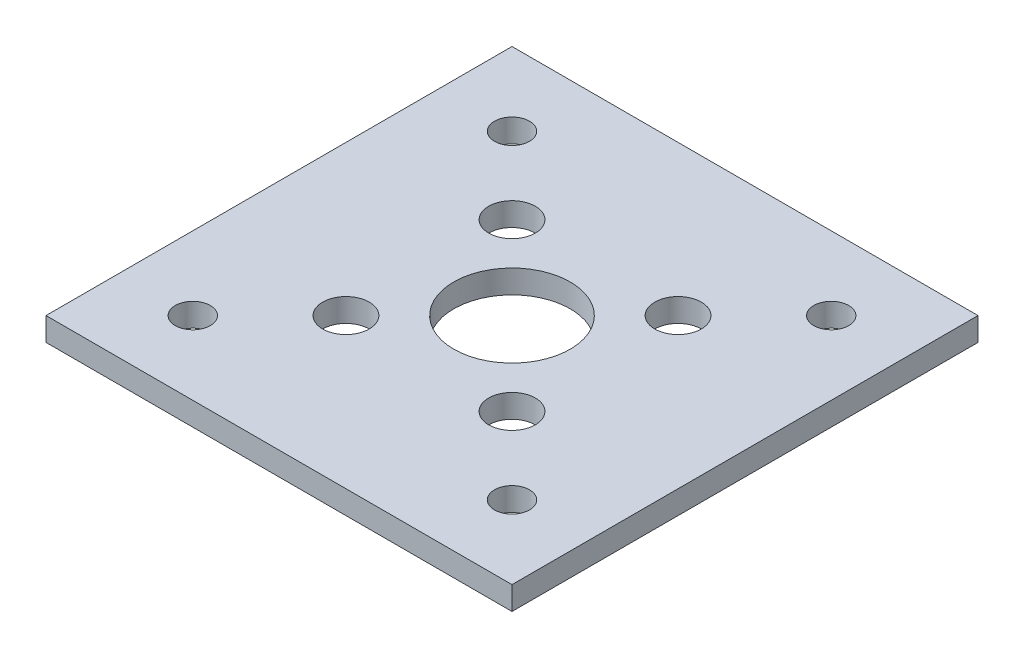
ISO-10303-21;
HEADER;
FILE_DESCRIPTION(('STEP AP214'),'2;1');
FILE_NAME('part.step','',(''),(''),'','','');
FILE_SCHEMA(('AUTOMOTIVE_DESIGN { 1 0 10303 214 1 1 1 1 }'));
ENDSEC;
DATA;
#1=APPLICATION_CONTEXT('core data for automotive mechanical design processes');
#2=APPLICATION_PROTOCOL_DEFINITION('international standard','automotive_design',2000,#1);
#3=PRODUCT_CONTEXT('',#1,'mechanical');
#4=PRODUCT('Part','Part','',(#3));
#5=PRODUCT_RELATED_PRODUCT_CATEGORY('part','',(#4));
#6=PRODUCT_DEFINITION_FORMATION('','',#4);
#7=PRODUCT_DEFINITION_CONTEXT('part definition',#1,'design');
#8=PRODUCT_DEFINITION('design','',#6,#7);
#9=PRODUCT_DEFINITION_SHAPE('','',#8);
#10=(LENGTH_UNIT() NAMED_UNIT(*) SI_UNIT(.MILLI.,.METRE.));
#11=(NAMED_UNIT(*) PLANE_ANGLE_UNIT() SI_UNIT($,.RADIAN.));
#12=(NAMED_UNIT(*) SI_UNIT($,.STERADIAN.) SOLID_ANGLE_UNIT());
#13=UNCERTAINTY_MEASURE_WITH_UNIT(LENGTH_MEASURE(1.E-05),#10,'distance_accuracy_value','');
#14=(GEOMETRIC_REPRESENTATION_CONTEXT(3) GLOBAL_UNCERTAINTY_ASSIGNED_CONTEXT((#13)) GLOBAL_UNIT_ASSIGNED_CONTEXT((#10,
#11,#12)) REPRESENTATION_CONTEXT('',''));
#15=CARTESIAN_POINT('',(0.,0.,0.));
#16=DIRECTION('',(0.,0.,1.));
#17=DIRECTION('',(1.,0.,0.));
#18=AXIS2_PLACEMENT_3D('',#15,#16,#17);
#19=CARTESIAN_POINT('',(31.75,3.175,31.75));
#20=DIRECTION('',(-1.,0.,0.));
#21=DIRECTION('',(0.,0.,1.));
#22=AXIS2_PLACEMENT_3D('',#19,#20,#21);
#23=PLANE('',#22);
#24=DIRECTION('',(0.,0.,-1.));
#25=VECTOR('',#24,1.);
#26=CARTESIAN_POINT('',(31.75,0.,31.75));
#27=LINE('',#26,#25);
#28=CARTESIAN_POINT('',(31.75,0.,31.75));
#29=VERTEX_POINT('',#28);
#30=CARTESIAN_POINT('',(31.75,0.,-31.75));
#31=VERTEX_POINT('',#30);
#32=EDGE_CURVE('E96',#29,#31,#27,.T.);
#33=ORIENTED_EDGE('',*,*,#32,.T.);
#34=DIRECTION('',(0.,-1.,0.));
#35=VECTOR('',#34,1.);
#36=CARTESIAN_POINT('',(31.75,3.175,-31.75));
#37=LINE('',#36,#35);
#38=CARTESIAN_POINT('',(31.75,3.175,-31.75));
#39=VERTEX_POINT('',#38);
#40=EDGE_CURVE('E11',#39,#31,#37,.T.);
#41=ORIENTED_EDGE('',*,*,#40,.F.);
#42=DIRECTION('',(0.,0.,-1.));
#43=VECTOR('',#42,1.);
#44=CARTESIAN_POINT('',(31.75,3.175,31.75));
#45=LINE('',#44,#43);
#46=CARTESIAN_POINT('',(31.75,3.175,31.75));
#47=VERTEX_POINT('',#46);
#48=EDGE_CURVE('E84',#47,#39,#45,.T.);
#49=ORIENTED_EDGE('',*,*,#48,.F.);
#50=DIRECTION('',(0.,-1.,0.));
#51=VECTOR('',#50,1.);
#52=CARTESIAN_POINT('',(31.75,3.175,31.75));
#53=LINE('',#52,#51);
#54=EDGE_CURVE('E92',#47,#29,#53,.T.);
#55=ORIENTED_EDGE('',*,*,#54,.T.);
#56=EDGE_LOOP('',(#33,#41,#49,#55));
#57=FACE_BOUND('',#56,.T.);
#58=ADVANCED_FACE('F33',(#57),#23,.F.);
#59=CARTESIAN_POINT('',(-31.75,3.175,-31.75));
#60=DIRECTION('',(0.,0.,1.));
#61=DIRECTION('',(1.,0.,0.));
#62=AXIS2_PLACEMENT_3D('',#59,#60,#61);
#63=PLANE('',#62);
#64=DIRECTION('',(-1.,0.,0.));
#65=VECTOR('',#64,1.);
#66=CARTESIAN_POINT('',(-31.75,0.,-31.75));
#67=LINE('',#66,#65);
#68=CARTESIAN_POINT('',(-31.75,0.,-31.75));
#69=VERTEX_POINT('',#68);
#70=EDGE_CURVE('E88',#31,#69,#67,.T.);
#71=ORIENTED_EDGE('',*,*,#70,.T.);
#72=DIRECTION('',(0.,-1.,0.));
#73=VECTOR('',#72,1.);
#74=CARTESIAN_POINT('',(-31.75,3.175,-31.75));
#75=LINE('',#74,#73);
#76=CARTESIAN_POINT('',(-31.75,3.175,-31.75));
#77=VERTEX_POINT('',#76);
#78=EDGE_CURVE('E41',#77,#69,#75,.T.);
#79=ORIENTED_EDGE('',*,*,#78,.F.);
#80=DIRECTION('',(-1.,0.,0.));
#81=VECTOR('',#80,1.);
#82=CARTESIAN_POINT('',(-31.75,3.175,-31.75));
#83=LINE('',#82,#81);
#84=EDGE_CURVE('E79',#39,#77,#83,.T.);
#85=ORIENTED_EDGE('',*,*,#84,.F.);
#86=ORIENTED_EDGE('',*,*,#40,.T.);
#87=EDGE_LOOP('',(#71,#79,#85,#86));
#88=FACE_BOUND('',#87,.T.);
#89=ADVANCED_FACE('F87',(#88),#63,.F.);
#90=CARTESIAN_POINT('',(-31.75,3.175,31.75));
#91=DIRECTION('',(1.,0.,0.));
#92=DIRECTION('',(0.,0.,-1.));
#93=AXIS2_PLACEMENT_3D('',#90,#91,#92);
#94=PLANE('',#93);
#95=DIRECTION('',(0.,0.,1.));
#96=VECTOR('',#95,1.);
#97=CARTESIAN_POINT('',(-31.75,0.,31.75));
#98=LINE('',#97,#96);
#99=CARTESIAN_POINT('',(-31.75,0.,31.75));
#100=VERTEX_POINT('',#99);
#101=EDGE_CURVE('E66',#69,#100,#98,.T.);
#102=ORIENTED_EDGE('',*,*,#101,.T.);
#103=DIRECTION('',(0.,-1.,0.));
#104=VECTOR('',#103,1.);
#105=CARTESIAN_POINT('',(-31.75,3.175,31.75));
#106=LINE('',#105,#104);
#107=CARTESIAN_POINT('',(-31.75,3.175,31.75));
#108=VERTEX_POINT('',#107);
#109=EDGE_CURVE('E89',#108,#100,#106,.T.);
#110=ORIENTED_EDGE('',*,*,#109,.F.);
#111=DIRECTION('',(0.,0.,1.));
#112=VECTOR('',#111,1.);
#113=CARTESIAN_POINT('',(-31.75,3.175,31.75));
#114=LINE('',#113,#112);
#115=EDGE_CURVE('E82',#77,#108,#114,.T.);
#116=ORIENTED_EDGE('',*,*,#115,.F.);
#117=ORIENTED_EDGE('',*,*,#78,.T.);
#118=EDGE_LOOP('',(#102,#110,#116,#117));
#119=FACE_BOUND('',#118,.T.);
#120=ADVANCED_FACE('F90',(#119),#94,.F.);
#121=CARTESIAN_POINT('',(-31.75,3.175,31.75));
#122=DIRECTION('',(0.,0.,-1.));
#123=DIRECTION('',(-1.,0.,0.));
#124=AXIS2_PLACEMENT_3D('',#121,#122,#123);
#125=PLANE('',#124);
#126=DIRECTION('',(1.,0.,0.));
#127=VECTOR('',#126,1.);
#128=CARTESIAN_POINT('',(-31.75,0.,31.75));
#129=LINE('',#128,#127);
#130=EDGE_CURVE('E72',#100,#29,#129,.T.);
#131=ORIENTED_EDGE('',*,*,#130,.T.);
#132=ORIENTED_EDGE('',*,*,#54,.F.);
#133=DIRECTION('',(1.,0.,0.));
#134=VECTOR('',#133,1.);
#135=CARTESIAN_POINT('',(-31.75,3.175,31.75));
#136=LINE('',#135,#134);
#137=EDGE_CURVE('E49',#108,#47,#136,.T.);
#138=ORIENTED_EDGE('',*,*,#137,.F.);
#139=ORIENTED_EDGE('',*,*,#109,.T.);
#140=EDGE_LOOP('',(#131,#132,#138,#139));
#141=FACE_BOUND('',#140,.T.);
#142=ADVANCED_FACE('F104',(#141),#125,.F.);
#143=CARTESIAN_POINT('',(0.,3.175,0.));
#144=DIRECTION('',(0.,-1.,0.));
#145=DIRECTION('',(0.,0.,-1.));
#146=AXIS2_PLACEMENT_3D('',#143,#144,#145);
#147=PLANE('',#146);
#148=CARTESIAN_POINT('',(0.,3.175,0.));
#149=DIRECTION('',(0.,1.,0.));
#150=DIRECTION('',(0.,0.,1.));
#151=AXIS2_PLACEMENT_3D('',#148,#149,#150);
#152=CIRCLE('',#151,7.9375);
#153=CARTESIAN_POINT('',(0.,3.175,7.9375));
#154=VERTEX_POINT('',#153);
#155=EDGE_CURVE('E135',#154,#154,#152,.T.);
#156=ORIENTED_EDGE('',*,*,#155,.F.);
#157=EDGE_LOOP('',(#156));
#158=FACE_BOUND('',#157,.T.);
#159=CARTESIAN_POINT('',(11.3137084989847,3.175,11.3137084989848));
#160=DIRECTION('',(0.,1.,0.));
#161=DIRECTION('',(0.,0.,1.));
#162=AXIS2_PLACEMENT_3D('',#159,#160,#161);
#163=CIRCLE('',#162,3.175);
#164=CARTESIAN_POINT('',(11.3137084989847,3.175,14.4887084989848));
#165=VERTEX_POINT('',#164);
#166=EDGE_CURVE('E129',#165,#165,#163,.T.);
#167=ORIENTED_EDGE('',*,*,#166,.F.);
#168=EDGE_LOOP('',(#167));
#169=FACE_BOUND('',#168,.T.);
#170=CARTESIAN_POINT('',(-11.3137084989848,3.175,11.3137084989847));
#171=DIRECTION('',(0.,1.,0.));
#172=DIRECTION('',(0.,0.,1.));
#173=AXIS2_PLACEMENT_3D('',#170,#171,#172);
#174=CIRCLE('',#173,3.175);
#175=CARTESIAN_POINT('',(-11.3137084989848,3.175,14.4887084989847));
#176=VERTEX_POINT('',#175);
#177=EDGE_CURVE('E123',#176,#176,#174,.T.);
#178=ORIENTED_EDGE('',*,*,#177,.F.);
#179=EDGE_LOOP('',(#178));
#180=FACE_BOUND('',#179,.T.);
#181=CARTESIAN_POINT('',(-11.3137084989847,3.175,-11.3137084989848));
#182=DIRECTION('',(0.,1.,0.));
#183=DIRECTION('',(0.,0.,1.));
#184=AXIS2_PLACEMENT_3D('',#181,#182,#183);
#185=CIRCLE('',#184,3.175);
#186=CARTESIAN_POINT('',(-11.3137084989847,3.175,-8.13870849898478));
#187=VERTEX_POINT('',#186);
#188=EDGE_CURVE('E116',#187,#187,#185,.T.);
#189=ORIENTED_EDGE('',*,*,#188,.F.);
#190=EDGE_LOOP('',(#189));
#191=FACE_BOUND('',#190,.T.);
#192=CARTESIAN_POINT('',(-21.75,3.175,21.75));
#193=DIRECTION('',(0.,1.,0.));
#194=DIRECTION('',(0.,0.,1.));
#195=AXIS2_PLACEMENT_3D('',#192,#193,#194);
#196=CIRCLE('',#195,2.38125);
#197=CARTESIAN_POINT('',(-21.75,3.175,24.13125));
#198=VERTEX_POINT('',#197);
#199=EDGE_CURVE('E158',#198,#198,#196,.T.);
#200=ORIENTED_EDGE('',*,*,#199,.F.);
#201=EDGE_LOOP('',(#200));
#202=FACE_BOUND('',#201,.T.);
#203=CARTESIAN_POINT('',(21.75,3.175,21.75));
#204=DIRECTION('',(0.,1.,0.));
#205=DIRECTION('',(0.,0.,1.));
#206=AXIS2_PLACEMENT_3D('',#203,#204,#205);
#207=CIRCLE('',#206,2.38125);
#208=CARTESIAN_POINT('',(21.75,3.175,24.13125));
#209=VERTEX_POINT('',#208);
#210=EDGE_CURVE('E152',#209,#209,#207,.T.);
#211=ORIENTED_EDGE('',*,*,#210,.F.);
#212=EDGE_LOOP('',(#211));
#213=FACE_BOUND('',#212,.T.);
#214=CARTESIAN_POINT('',(21.75,3.175,-21.75));
#215=DIRECTION('',(0.,1.,0.));
#216=DIRECTION('',(0.,0.,1.));
#217=AXIS2_PLACEMENT_3D('',#214,#215,#216);
#218=CIRCLE('',#217,2.38125);
#219=CARTESIAN_POINT('',(21.75,3.175,-19.36875));
#220=VERTEX_POINT('',#219);
#221=EDGE_CURVE('E146',#220,#220,#218,.T.);
#222=ORIENTED_EDGE('',*,*,#221,.F.);
#223=EDGE_LOOP('',(#222));
#224=FACE_BOUND('',#223,.T.);
#225=CARTESIAN_POINT('',(-21.75,3.175,-21.75));
#226=DIRECTION('',(0.,1.,0.));
#227=DIRECTION('',(0.,0.,1.));
#228=AXIS2_PLACEMENT_3D('',#225,#226,#227);
#229=CIRCLE('',#228,2.38125);
#230=CARTESIAN_POINT('',(-21.75,3.175,-19.36875));
#231=VERTEX_POINT('',#230);
#232=EDGE_CURVE('E140',#231,#231,#229,.T.);
#233=ORIENTED_EDGE('',*,*,#232,.F.);
#234=EDGE_LOOP('',(#233));
#235=FACE_BOUND('',#234,.T.);
#236=CARTESIAN_POINT('',(11.3137084989848,3.175,-11.3137084989847));
#237=DIRECTION('',(0.,1.,0.));
#238=DIRECTION('',(0.,0.,1.));
#239=AXIS2_PLACEMENT_3D('',#236,#237,#238);
#240=CIRCLE('',#239,3.175);
#241=CARTESIAN_POINT('',(11.3137084989848,3.175,-8.13870849898475));
#242=VERTEX_POINT('',#241);
#243=EDGE_CURVE('E110',#242,#242,#240,.T.);
#244=ORIENTED_EDGE('',*,*,#243,.F.);
#245=EDGE_LOOP('',(#244));
#246=FACE_BOUND('',#245,.T.);
#247=ORIENTED_EDGE('',*,*,#48,.T.);
#248=ORIENTED_EDGE('',*,*,#84,.T.);
#249=ORIENTED_EDGE('',*,*,#115,.T.);
#250=ORIENTED_EDGE('',*,*,#137,.T.);
#251=EDGE_LOOP('',(#247,#248,#249,#250));
#252=FACE_BOUND('',#251,.T.);
#253=ADVANCED_FACE('F80',(#158,#169,#180,#191,#202,#213,#224,#235,#246,#252),#147,.F.);
#254=CARTESIAN_POINT('',(0.,0.,0.));
#255=DIRECTION('',(0.,-1.,0.));
#256=DIRECTION('',(0.,0.,-1.));
#257=AXIS2_PLACEMENT_3D('',#254,#255,#256);
#258=PLANE('',#257);
#259=CARTESIAN_POINT('',(0.,0.,0.));
#260=DIRECTION('',(0.,1.,0.));
#261=DIRECTION('',(0.,0.,1.));
#262=AXIS2_PLACEMENT_3D('',#259,#260,#261);
#263=CIRCLE('',#262,7.9375);
#264=CARTESIAN_POINT('',(0.,0.,7.9375));
#265=VERTEX_POINT('',#264);
#266=EDGE_CURVE('E113',#265,#265,#263,.T.);
#267=ORIENTED_EDGE('',*,*,#266,.T.);
#268=EDGE_LOOP('',(#267));
#269=FACE_BOUND('',#268,.T.);
#270=CARTESIAN_POINT('',(11.3137084989847,0.,11.3137084989848));
#271=DIRECTION('',(0.,1.,0.));
#272=DIRECTION('',(0.,0.,1.));
#273=AXIS2_PLACEMENT_3D('',#270,#271,#272);
#274=CIRCLE('',#273,3.175);
#275=CARTESIAN_POINT('',(11.3137084989847,0.,14.4887084989848));
#276=VERTEX_POINT('',#275);
#277=EDGE_CURVE('E132',#276,#276,#274,.T.);
#278=ORIENTED_EDGE('',*,*,#277,.T.);
#279=EDGE_LOOP('',(#278));
#280=FACE_BOUND('',#279,.T.);
#281=CARTESIAN_POINT('',(-11.3137084989848,0.,11.3137084989847));
#282=DIRECTION('',(0.,1.,0.));
#283=DIRECTION('',(0.,0.,1.));
#284=AXIS2_PLACEMENT_3D('',#281,#282,#283);
#285=CIRCLE('',#284,3.175);
#286=CARTESIAN_POINT('',(-11.3137084989848,0.,14.4887084989847));
#287=VERTEX_POINT('',#286);
#288=EDGE_CURVE('E126',#287,#287,#285,.T.);
#289=ORIENTED_EDGE('',*,*,#288,.T.);
#290=EDGE_LOOP('',(#289));
#291=FACE_BOUND('',#290,.T.);
#292=CARTESIAN_POINT('',(-11.3137084989847,0.,-11.3137084989848));
#293=DIRECTION('',(0.,1.,0.));
#294=DIRECTION('',(0.,0.,1.));
#295=AXIS2_PLACEMENT_3D('',#292,#293,#294);
#296=CIRCLE('',#295,3.175);
#297=CARTESIAN_POINT('',(-11.3137084989847,0.,-8.13870849898478));
#298=VERTEX_POINT('',#297);
#299=EDGE_CURVE('E119',#298,#298,#296,.T.);
#300=ORIENTED_EDGE('',*,*,#299,.T.);
#301=EDGE_LOOP('',(#300));
#302=FACE_BOUND('',#301,.T.);
#303=CARTESIAN_POINT('',(-21.75,0.,21.75));
#304=DIRECTION('',(0.,1.,0.));
#305=DIRECTION('',(0.,0.,1.));
#306=AXIS2_PLACEMENT_3D('',#303,#304,#305);
#307=CIRCLE('',#306,2.38125);
#308=CARTESIAN_POINT('',(-21.75,0.,24.13125));
#309=VERTEX_POINT('',#308);
#310=EDGE_CURVE('E120',#309,#309,#307,.T.);
#311=ORIENTED_EDGE('',*,*,#310,.T.);
#312=EDGE_LOOP('',(#311));
#313=FACE_BOUND('',#312,.T.);
#314=CARTESIAN_POINT('',(21.75,0.,21.75));
#315=DIRECTION('',(0.,1.,0.));
#316=DIRECTION('',(0.,0.,1.));
#317=AXIS2_PLACEMENT_3D('',#314,#315,#316);
#318=CIRCLE('',#317,2.38125);
#319=CARTESIAN_POINT('',(21.75,0.,24.13125));
#320=VERTEX_POINT('',#319);
#321=EDGE_CURVE('E155',#320,#320,#318,.T.);
#322=ORIENTED_EDGE('',*,*,#321,.T.);
#323=EDGE_LOOP('',(#322));
#324=FACE_BOUND('',#323,.T.);
#325=CARTESIAN_POINT('',(21.75,0.,-21.75));
#326=DIRECTION('',(0.,1.,0.));
#327=DIRECTION('',(0.,0.,1.));
#328=AXIS2_PLACEMENT_3D('',#325,#326,#327);
#329=CIRCLE('',#328,2.38125);
#330=CARTESIAN_POINT('',(21.75,0.,-19.36875));
#331=VERTEX_POINT('',#330);
#332=EDGE_CURVE('E149',#331,#331,#329,.T.);
#333=ORIENTED_EDGE('',*,*,#332,.T.);
#334=EDGE_LOOP('',(#333));
#335=FACE_BOUND('',#334,.T.);
#336=CARTESIAN_POINT('',(-21.75,0.,-21.75));
#337=DIRECTION('',(0.,1.,0.));
#338=DIRECTION('',(0.,0.,1.));
#339=AXIS2_PLACEMENT_3D('',#336,#337,#338);
#340=CIRCLE('',#339,2.38125);
#341=CARTESIAN_POINT('',(-21.75,0.,-19.36875));
#342=VERTEX_POINT('',#341);
#343=EDGE_CURVE('E143',#342,#342,#340,.T.);
#344=ORIENTED_EDGE('',*,*,#343,.T.);
#345=EDGE_LOOP('',(#344));
#346=FACE_BOUND('',#345,.T.);
#347=CARTESIAN_POINT('',(11.3137084989848,0.,-11.3137084989847));
#348=DIRECTION('',(0.,1.,0.));
#349=DIRECTION('',(0.,0.,1.));
#350=AXIS2_PLACEMENT_3D('',#347,#348,#349);
#351=CIRCLE('',#350,3.175);
#352=CARTESIAN_POINT('',(11.3137084989848,0.,-8.13870849898475));
#353=VERTEX_POINT('',#352);
#354=EDGE_CURVE('E99',#353,#353,#351,.T.);
#355=ORIENTED_EDGE('',*,*,#354,.T.);
#356=EDGE_LOOP('',(#355));
#357=FACE_BOUND('',#356,.T.);
#358=ORIENTED_EDGE('',*,*,#32,.F.);
#359=ORIENTED_EDGE('',*,*,#130,.F.);
#360=ORIENTED_EDGE('',*,*,#101,.F.);
#361=ORIENTED_EDGE('',*,*,#70,.F.);
#362=EDGE_LOOP('',(#358,#359,#360,#361));
#363=FACE_BOUND('',#362,.T.);
#364=ADVANCED_FACE('F107',(#269,#280,#291,#302,#313,#324,#335,#346,#357,#363),#258,.T.);
#365=CARTESIAN_POINT('',(11.3137084989848,0.,-11.3137084989847));
#366=DIRECTION('',(0.,1.,0.));
#367=DIRECTION('',(0.,0.,1.));
#368=AXIS2_PLACEMENT_3D('',#365,#366,#367);
#369=CYLINDRICAL_SURFACE('',#368,3.175);
#370=ORIENTED_EDGE('',*,*,#354,.F.);
#371=EDGE_LOOP('',(#370));
#372=FACE_BOUND('',#371,.T.);
#373=ORIENTED_EDGE('',*,*,#243,.T.);
#374=EDGE_LOOP('',(#373));
#375=FACE_BOUND('',#374,.T.);
#376=ADVANCED_FACE('F186',(#372,#375),#369,.F.);
#377=CARTESIAN_POINT('',(-21.75,0.,-21.75));
#378=DIRECTION('',(0.,1.,0.));
#379=DIRECTION('',(0.,0.,1.));
#380=AXIS2_PLACEMENT_3D('',#377,#378,#379);
#381=CYLINDRICAL_SURFACE('',#380,2.38125);
#382=ORIENTED_EDGE('',*,*,#343,.F.);
#383=EDGE_LOOP('',(#382));
#384=FACE_BOUND('',#383,.T.);
#385=ORIENTED_EDGE('',*,*,#232,.T.);
#386=EDGE_LOOP('',(#385));
#387=FACE_BOUND('',#386,.T.);
#388=ADVANCED_FACE('F188',(#384,#387),#381,.F.);
#389=CARTESIAN_POINT('',(21.75,0.,-21.75));
#390=DIRECTION('',(0.,1.,0.));
#391=DIRECTION('',(0.,0.,1.));
#392=AXIS2_PLACEMENT_3D('',#389,#390,#391);
#393=CYLINDRICAL_SURFACE('',#392,2.38125);
#394=ORIENTED_EDGE('',*,*,#332,.F.);
#395=EDGE_LOOP('',(#394));
#396=FACE_BOUND('',#395,.T.);
#397=ORIENTED_EDGE('',*,*,#221,.T.);
#398=EDGE_LOOP('',(#397));
#399=FACE_BOUND('',#398,.T.);
#400=ADVANCED_FACE('F195',(#396,#399),#393,.F.);
#401=CARTESIAN_POINT('',(21.75,0.,21.75));
#402=DIRECTION('',(0.,1.,0.));
#403=DIRECTION('',(0.,0.,1.));
#404=AXIS2_PLACEMENT_3D('',#401,#402,#403);
#405=CYLINDRICAL_SURFACE('',#404,2.38125);
#406=ORIENTED_EDGE('',*,*,#321,.F.);
#407=EDGE_LOOP('',(#406));
#408=FACE_BOUND('',#407,.T.);
#409=ORIENTED_EDGE('',*,*,#210,.T.);
#410=EDGE_LOOP('',(#409));
#411=FACE_BOUND('',#410,.T.);
#412=ADVANCED_FACE('F170',(#408,#411),#405,.F.);
#413=CARTESIAN_POINT('',(-21.75,0.,21.75));
#414=DIRECTION('',(0.,1.,0.));
#415=DIRECTION('',(0.,0.,1.));
#416=AXIS2_PLACEMENT_3D('',#413,#414,#415);
#417=CYLINDRICAL_SURFACE('',#416,2.38125);
#418=ORIENTED_EDGE('',*,*,#310,.F.);
#419=EDGE_LOOP('',(#418));
#420=FACE_BOUND('',#419,.T.);
#421=ORIENTED_EDGE('',*,*,#199,.T.);
#422=EDGE_LOOP('',(#421));
#423=FACE_BOUND('',#422,.T.);
#424=ADVANCED_FACE('F166',(#420,#423),#417,.F.);
#425=CARTESIAN_POINT('',(-11.3137084989847,0.,-11.3137084989848));
#426=DIRECTION('',(0.,1.,0.));
#427=DIRECTION('',(0.,0.,1.));
#428=AXIS2_PLACEMENT_3D('',#425,#426,#427);
#429=CYLINDRICAL_SURFACE('',#428,3.175);
#430=ORIENTED_EDGE('',*,*,#299,.F.);
#431=EDGE_LOOP('',(#430));
#432=FACE_BOUND('',#431,.T.);
#433=ORIENTED_EDGE('',*,*,#188,.T.);
#434=EDGE_LOOP('',(#433));
#435=FACE_BOUND('',#434,.T.);
#436=ADVANCED_FACE('F169',(#432,#435),#429,.F.);
#437=CARTESIAN_POINT('',(-11.3137084989848,0.,11.3137084989847));
#438=DIRECTION('',(0.,1.,0.));
#439=DIRECTION('',(0.,0.,1.));
#440=AXIS2_PLACEMENT_3D('',#437,#438,#439);
#441=CYLINDRICAL_SURFACE('',#440,3.175);
#442=ORIENTED_EDGE('',*,*,#288,.F.);
#443=EDGE_LOOP('',(#442));
#444=FACE_BOUND('',#443,.T.);
#445=ORIENTED_EDGE('',*,*,#177,.T.);
#446=EDGE_LOOP('',(#445));
#447=FACE_BOUND('',#446,.T.);
#448=ADVANCED_FACE('F267',(#444,#447),#441,.F.);
#449=CARTESIAN_POINT('',(11.3137084989847,0.,11.3137084989848));
#450=DIRECTION('',(0.,1.,0.));
#451=DIRECTION('',(0.,0.,1.));
#452=AXIS2_PLACEMENT_3D('',#449,#450,#451);
#453=CYLINDRICAL_SURFACE('',#452,3.175);
#454=ORIENTED_EDGE('',*,*,#277,.F.);
#455=EDGE_LOOP('',(#454));
#456=FACE_BOUND('',#455,.T.);
#457=ORIENTED_EDGE('',*,*,#166,.T.);
#458=EDGE_LOOP('',(#457));
#459=FACE_BOUND('',#458,.T.);
#460=ADVANCED_FACE('F276',(#456,#459),#453,.F.);
#461=CARTESIAN_POINT('',(0.,0.,0.));
#462=DIRECTION('',(0.,1.,0.));
#463=DIRECTION('',(0.,0.,1.));
#464=AXIS2_PLACEMENT_3D('',#461,#462,#463);
#465=CYLINDRICAL_SURFACE('',#464,7.9375);
#466=ORIENTED_EDGE('',*,*,#266,.F.);
#467=EDGE_LOOP('',(#466));
#468=FACE_BOUND('',#467,.T.);
#469=ORIENTED_EDGE('',*,*,#155,.T.);
#470=EDGE_LOOP('',(#469));
#471=FACE_BOUND('',#470,.T.);
#472=ADVANCED_FACE('F286',(#468,#471),#465,.F.);
#473=CLOSED_SHELL('',(#58,#89,#120,#142,#253,#364,#376,#388,#400,#412,#424,#436,#448,#460,#472));
#474=MANIFOLD_SOLID_BREP('B2',#473);
#475=ADVANCED_BREP_SHAPE_REPRESENTATION('',(#18,#474),#14);
#476=SHAPE_DEFINITION_REPRESENTATION(#9,#475);
ENDSEC;
END-ISO-10303-21;
